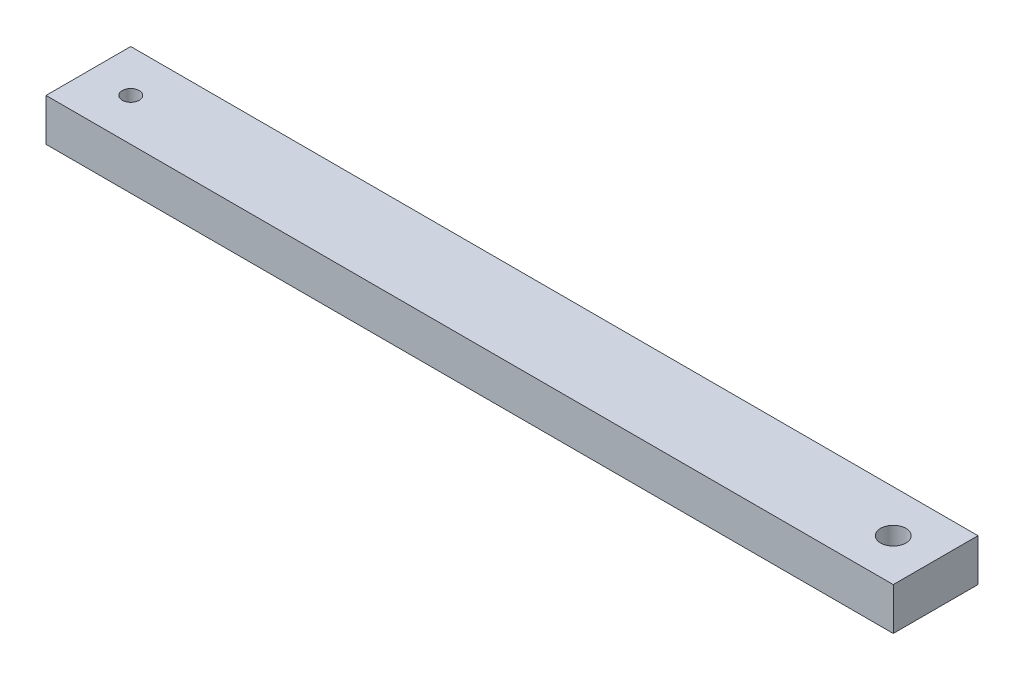
ISO-10303-21;
HEADER;
FILE_DESCRIPTION(('STEP AP214'),'2;1');
FILE_NAME('part.step','',(''),(''),'','','');
FILE_SCHEMA(('AUTOMOTIVE_DESIGN { 1 0 10303 214 1 1 1 1 }'));
ENDSEC;
DATA;
#1=APPLICATION_CONTEXT('core data for automotive mechanical design processes');
#2=APPLICATION_PROTOCOL_DEFINITION('international standard','automotive_design',2000,#1);
#3=PRODUCT_CONTEXT('',#1,'mechanical');
#4=PRODUCT('Part','Part','',(#3));
#5=PRODUCT_RELATED_PRODUCT_CATEGORY('part','',(#4));
#6=PRODUCT_DEFINITION_FORMATION('','',#4);
#7=PRODUCT_DEFINITION_CONTEXT('part definition',#1,'design');
#8=PRODUCT_DEFINITION('design','',#6,#7);
#9=PRODUCT_DEFINITION_SHAPE('','',#8);
#10=(LENGTH_UNIT() NAMED_UNIT(*) SI_UNIT(.MILLI.,.METRE.));
#11=(NAMED_UNIT(*) PLANE_ANGLE_UNIT() SI_UNIT($,.RADIAN.));
#12=(NAMED_UNIT(*) SI_UNIT($,.STERADIAN.) SOLID_ANGLE_UNIT());
#13=UNCERTAINTY_MEASURE_WITH_UNIT(LENGTH_MEASURE(1.E-05),#10,'distance_accuracy_value','');
#14=(GEOMETRIC_REPRESENTATION_CONTEXT(3) GLOBAL_UNCERTAINTY_ASSIGNED_CONTEXT((#13)) GLOBAL_UNIT_ASSIGNED_CONTEXT((#10,
#11,#12)) REPRESENTATION_CONTEXT('',''));
#15=CARTESIAN_POINT('',(0.,0.,0.));
#16=DIRECTION('',(0.,0.,1.));
#17=DIRECTION('',(1.,0.,0.));
#18=AXIS2_PLACEMENT_3D('',#15,#16,#17);
#19=CARTESIAN_POINT('',(0.,5.,10.));
#20=DIRECTION('',(1.,0.,0.));
#21=DIRECTION('',(0.,0.,-1.));
#22=AXIS2_PLACEMENT_3D('',#19,#20,#21);
#23=PLANE('',#22);
#24=DIRECTION('',(0.,-1.,0.));
#25=VECTOR('',#24,1.);
#26=CARTESIAN_POINT('',(0.,5.,0.));
#27=LINE('',#26,#25);
#28=CARTESIAN_POINT('',(0.,5.,0.));
#29=VERTEX_POINT('',#28);
#30=CARTESIAN_POINT('',(0.,0.,0.));
#31=VERTEX_POINT('',#30);
#32=EDGE_CURVE('E97',#29,#31,#27,.T.);
#33=ORIENTED_EDGE('',*,*,#32,.T.);
#34=DIRECTION('',(0.,0.,-1.));
#35=VECTOR('',#34,1.);
#36=CARTESIAN_POINT('',(0.,0.,10.));
#37=LINE('',#36,#35);
#38=CARTESIAN_POINT('',(0.,0.,10.));
#39=VERTEX_POINT('',#38);
#40=EDGE_CURVE('E11',#39,#31,#37,.T.);
#41=ORIENTED_EDGE('',*,*,#40,.F.);
#42=DIRECTION('',(0.,-1.,0.));
#43=VECTOR('',#42,1.);
#44=CARTESIAN_POINT('',(0.,5.,10.));
#45=LINE('',#44,#43);
#46=CARTESIAN_POINT('',(0.,5.,10.));
#47=VERTEX_POINT('',#46);
#48=EDGE_CURVE('E85',#47,#39,#45,.T.);
#49=ORIENTED_EDGE('',*,*,#48,.F.);
#50=DIRECTION('',(0.,0.,-1.));
#51=VECTOR('',#50,1.);
#52=CARTESIAN_POINT('',(0.,5.,10.));
#53=LINE('',#52,#51);
#54=EDGE_CURVE('E93',#47,#29,#53,.T.);
#55=ORIENTED_EDGE('',*,*,#54,.T.);
#56=EDGE_LOOP('',(#33,#41,#49,#55));
#57=FACE_BOUND('',#56,.T.);
#58=ADVANCED_FACE('F34',(#57),#23,.F.);
#59=CARTESIAN_POINT('',(0.,0.,10.));
#60=DIRECTION('',(0.,1.,0.));
#61=DIRECTION('',(0.,0.,1.));
#62=AXIS2_PLACEMENT_3D('',#59,#60,#61);
#63=PLANE('',#62);
#64=CARTESIAN_POINT('',(5.,0.,5.));
#65=DIRECTION('',(0.,1.,0.));
#66=DIRECTION('',(0.,0.,1.));
#67=AXIS2_PLACEMENT_3D('',#64,#65,#66);
#68=CIRCLE('',#67,1.);
#69=CARTESIAN_POINT('',(5.,0.,6.));
#70=VERTEX_POINT('',#69);
#71=EDGE_CURVE('E100',#70,#70,#68,.T.);
#72=ORIENTED_EDGE('',*,*,#71,.T.);
#73=EDGE_LOOP('',(#72));
#74=FACE_BOUND('',#73,.T.);
#75=CARTESIAN_POINT('',(95.,0.,5.));
#76=DIRECTION('',(0.,1.,0.));
#77=DIRECTION('',(0.,0.,1.));
#78=AXIS2_PLACEMENT_3D('',#75,#76,#77);
#79=CIRCLE('',#78,1.5);
#80=CARTESIAN_POINT('',(95.,0.,6.5));
#81=VERTEX_POINT('',#80);
#82=EDGE_CURVE('E113',#81,#81,#79,.T.);
#83=ORIENTED_EDGE('',*,*,#82,.T.);
#84=EDGE_LOOP('',(#83));
#85=FACE_BOUND('',#84,.T.);
#86=DIRECTION('',(1.,0.,0.));
#87=VECTOR('',#86,1.);
#88=CARTESIAN_POINT('',(0.,0.,0.));
#89=LINE('',#88,#87);
#90=CARTESIAN_POINT('',(100.,0.,0.));
#91=VERTEX_POINT('',#90);
#92=EDGE_CURVE('E89',#31,#91,#89,.T.);
#93=ORIENTED_EDGE('',*,*,#92,.T.);
#94=DIRECTION('',(0.,0.,-1.));
#95=VECTOR('',#94,1.);
#96=CARTESIAN_POINT('',(100.,0.,10.));
#97=LINE('',#96,#95);
#98=CARTESIAN_POINT('',(100.,0.,10.));
#99=VERTEX_POINT('',#98);
#100=EDGE_CURVE('E42',#99,#91,#97,.T.);
#101=ORIENTED_EDGE('',*,*,#100,.F.);
#102=DIRECTION('',(1.,0.,0.));
#103=VECTOR('',#102,1.);
#104=CARTESIAN_POINT('',(0.,0.,10.));
#105=LINE('',#104,#103);
#106=EDGE_CURVE('E80',#39,#99,#105,.T.);
#107=ORIENTED_EDGE('',*,*,#106,.F.);
#108=ORIENTED_EDGE('',*,*,#40,.T.);
#109=EDGE_LOOP('',(#93,#101,#107,#108));
#110=FACE_BOUND('',#109,.T.);
#111=ADVANCED_FACE('F88',(#74,#85,#110),#63,.F.);
#112=CARTESIAN_POINT('',(100.,5.,10.));
#113=DIRECTION('',(-1.,0.,0.));
#114=DIRECTION('',(0.,0.,1.));
#115=AXIS2_PLACEMENT_3D('',#112,#113,#114);
#116=PLANE('',#115);
#117=DIRECTION('',(0.,1.,0.));
#118=VECTOR('',#117,1.);
#119=CARTESIAN_POINT('',(100.,5.,0.));
#120=LINE('',#119,#118);
#121=CARTESIAN_POINT('',(100.,5.,0.));
#122=VERTEX_POINT('',#121);
#123=EDGE_CURVE('E67',#91,#122,#120,.T.);
#124=ORIENTED_EDGE('',*,*,#123,.T.);
#125=DIRECTION('',(0.,0.,-1.));
#126=VECTOR('',#125,1.);
#127=CARTESIAN_POINT('',(100.,5.,10.));
#128=LINE('',#127,#126);
#129=CARTESIAN_POINT('',(100.,5.,10.));
#130=VERTEX_POINT('',#129);
#131=EDGE_CURVE('E90',#130,#122,#128,.T.);
#132=ORIENTED_EDGE('',*,*,#131,.F.);
#133=DIRECTION('',(0.,1.,0.));
#134=VECTOR('',#133,1.);
#135=CARTESIAN_POINT('',(100.,5.,10.));
#136=LINE('',#135,#134);
#137=EDGE_CURVE('E83',#99,#130,#136,.T.);
#138=ORIENTED_EDGE('',*,*,#137,.F.);
#139=ORIENTED_EDGE('',*,*,#100,.T.);
#140=EDGE_LOOP('',(#124,#132,#138,#139));
#141=FACE_BOUND('',#140,.T.);
#142=ADVANCED_FACE('F91',(#141),#116,.F.);
#143=CARTESIAN_POINT('',(0.,5.,10.));
#144=DIRECTION('',(0.,-1.,0.));
#145=DIRECTION('',(0.,0.,-1.));
#146=AXIS2_PLACEMENT_3D('',#143,#144,#145);
#147=PLANE('',#146);
#148=CARTESIAN_POINT('',(5.,5.,5.));
#149=DIRECTION('',(0.,1.,0.));
#150=DIRECTION('',(0.,0.,1.));
#151=AXIS2_PLACEMENT_3D('',#148,#149,#150);
#152=CIRCLE('',#151,1.);
#153=CARTESIAN_POINT('',(5.,5.,6.));
#154=VERTEX_POINT('',#153);
#155=EDGE_CURVE('E116',#154,#154,#152,.T.);
#156=ORIENTED_EDGE('',*,*,#155,.F.);
#157=EDGE_LOOP('',(#156));
#158=FACE_BOUND('',#157,.T.);
#159=CARTESIAN_POINT('',(95.,5.,5.));
#160=DIRECTION('',(0.,1.,0.));
#161=DIRECTION('',(0.,0.,1.));
#162=AXIS2_PLACEMENT_3D('',#159,#160,#161);
#163=CIRCLE('',#162,1.5);
#164=CARTESIAN_POINT('',(95.,5.,6.5));
#165=VERTEX_POINT('',#164);
#166=EDGE_CURVE('E117',#165,#165,#163,.T.);
#167=ORIENTED_EDGE('',*,*,#166,.F.);
#168=EDGE_LOOP('',(#167));
#169=FACE_BOUND('',#168,.T.);
#170=DIRECTION('',(-1.,0.,0.));
#171=VECTOR('',#170,1.);
#172=CARTESIAN_POINT('',(0.,5.,0.));
#173=LINE('',#172,#171);
#174=EDGE_CURVE('E73',#122,#29,#173,.T.);
#175=ORIENTED_EDGE('',*,*,#174,.T.);
#176=ORIENTED_EDGE('',*,*,#54,.F.);
#177=DIRECTION('',(-1.,0.,0.));
#178=VECTOR('',#177,1.);
#179=CARTESIAN_POINT('',(0.,5.,10.));
#180=LINE('',#179,#178);
#181=EDGE_CURVE('E50',#130,#47,#180,.T.);
#182=ORIENTED_EDGE('',*,*,#181,.F.);
#183=ORIENTED_EDGE('',*,*,#131,.T.);
#184=EDGE_LOOP('',(#175,#176,#182,#183));
#185=FACE_BOUND('',#184,.T.);
#186=ADVANCED_FACE('F105',(#158,#169,#185),#147,.F.);
#187=CARTESIAN_POINT('',(0.,0.,10.));
#188=DIRECTION('',(0.,0.,1.));
#189=DIRECTION('',(1.,0.,0.));
#190=AXIS2_PLACEMENT_3D('',#187,#188,#189);
#191=PLANE('',#190);
#192=ORIENTED_EDGE('',*,*,#48,.T.);
#193=ORIENTED_EDGE('',*,*,#106,.T.);
#194=ORIENTED_EDGE('',*,*,#137,.T.);
#195=ORIENTED_EDGE('',*,*,#181,.T.);
#196=EDGE_LOOP('',(#192,#193,#194,#195));
#197=FACE_BOUND('',#196,.T.);
#198=ADVANCED_FACE('F81',(#197),#191,.T.);
#199=CARTESIAN_POINT('',(0.,0.,0.));
#200=DIRECTION('',(0.,0.,1.));
#201=DIRECTION('',(1.,0.,0.));
#202=AXIS2_PLACEMENT_3D('',#199,#200,#201);
#203=PLANE('',#202);
#204=ORIENTED_EDGE('',*,*,#32,.F.);
#205=ORIENTED_EDGE('',*,*,#174,.F.);
#206=ORIENTED_EDGE('',*,*,#123,.F.);
#207=ORIENTED_EDGE('',*,*,#92,.F.);
#208=EDGE_LOOP('',(#204,#205,#206,#207));
#209=FACE_BOUND('',#208,.T.);
#210=ADVANCED_FACE('F108',(#209),#203,.F.);
#211=CARTESIAN_POINT('',(95.,-5.,5.));
#212=DIRECTION('',(0.,1.,0.));
#213=DIRECTION('',(0.,0.,1.));
#214=AXIS2_PLACEMENT_3D('',#211,#212,#213);
#215=CYLINDRICAL_SURFACE('',#214,1.5);
#216=ORIENTED_EDGE('',*,*,#166,.T.);
#217=EDGE_LOOP('',(#216));
#218=FACE_BOUND('',#217,.T.);
#219=ORIENTED_EDGE('',*,*,#82,.F.);
#220=EDGE_LOOP('',(#219));
#221=FACE_BOUND('',#220,.T.);
#222=ADVANCED_FACE('F131',(#218,#221),#215,.F.);
#223=CARTESIAN_POINT('',(5.,-5.,5.));
#224=DIRECTION('',(0.,1.,0.));
#225=DIRECTION('',(0.,0.,1.));
#226=AXIS2_PLACEMENT_3D('',#223,#224,#225);
#227=CYLINDRICAL_SURFACE('',#226,1.);
#228=ORIENTED_EDGE('',*,*,#155,.T.);
#229=EDGE_LOOP('',(#228));
#230=FACE_BOUND('',#229,.T.);
#231=ORIENTED_EDGE('',*,*,#71,.F.);
#232=EDGE_LOOP('',(#231));
#233=FACE_BOUND('',#232,.T.);
#234=ADVANCED_FACE('F123',(#230,#233),#227,.F.);
#235=CLOSED_SHELL('',(#58,#111,#142,#186,#198,#210,#222,#234));
#236=MANIFOLD_SOLID_BREP('B2',#235);
#237=ADVANCED_BREP_SHAPE_REPRESENTATION('',(#18,#236),#14);
#238=SHAPE_DEFINITION_REPRESENTATION(#9,#237);
ENDSEC;
END-ISO-10303-21;
